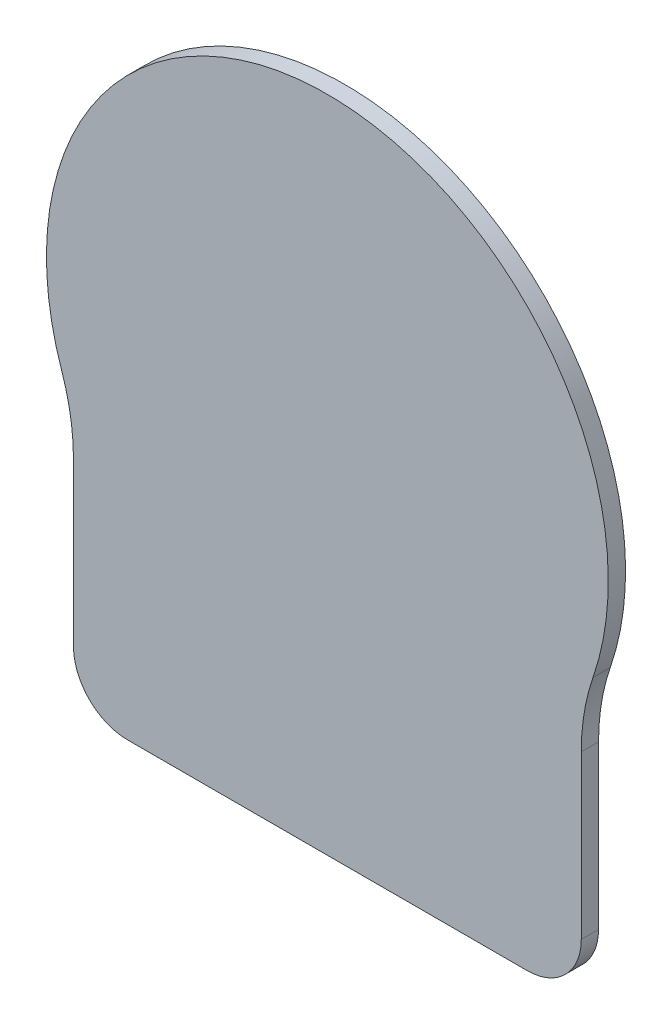
ISO-10303-21;
HEADER;
FILE_DESCRIPTION(('STEP AP214'),'2;1');
FILE_NAME('part.step','',(''),(''),'','','');
FILE_SCHEMA(('AUTOMOTIVE_DESIGN { 1 0 10303 214 1 1 1 1 }'));
ENDSEC;
DATA;
#1=APPLICATION_CONTEXT('core data for automotive mechanical design processes');
#2=APPLICATION_PROTOCOL_DEFINITION('international standard','automotive_design',2000,#1);
#3=PRODUCT_CONTEXT('',#1,'mechanical');
#4=PRODUCT('Part','Part','',(#3));
#5=PRODUCT_RELATED_PRODUCT_CATEGORY('part','',(#4));
#6=PRODUCT_DEFINITION_FORMATION('','',#4);
#7=PRODUCT_DEFINITION_CONTEXT('part definition',#1,'design');
#8=PRODUCT_DEFINITION('design','',#6,#7);
#9=PRODUCT_DEFINITION_SHAPE('','',#8);
#10=(LENGTH_UNIT() NAMED_UNIT(*) SI_UNIT(.MILLI.,.METRE.));
#11=(NAMED_UNIT(*) PLANE_ANGLE_UNIT() SI_UNIT($,.RADIAN.));
#12=(NAMED_UNIT(*) SI_UNIT($,.STERADIAN.) SOLID_ANGLE_UNIT());
#13=UNCERTAINTY_MEASURE_WITH_UNIT(LENGTH_MEASURE(1.E-05),#10,'distance_accuracy_value','');
#14=(GEOMETRIC_REPRESENTATION_CONTEXT(3) GLOBAL_UNCERTAINTY_ASSIGNED_CONTEXT((#13)) GLOBAL_UNIT_ASSIGNED_CONTEXT((#10,
#11,#12)) REPRESENTATION_CONTEXT('',''));
#15=CARTESIAN_POINT('',(0.,0.,0.));
#16=DIRECTION('',(0.,0.,1.));
#17=DIRECTION('',(1.,0.,0.));
#18=AXIS2_PLACEMENT_3D('',#15,#16,#17);
#19=CARTESIAN_POINT('',(-43.5,-14.9582753016516,1.6));
#20=DIRECTION('',(0.,0.,-1.));
#21=DIRECTION('',(-1.,0.,0.));
#22=AXIS2_PLACEMENT_3D('',#19,#20,#21);
#23=CYLINDRICAL_SURFACE('',#22,20.);
#24=CARTESIAN_POINT('',(-43.5,-14.9582753016516,0.));
#25=DIRECTION('',(0.,0.,-1.));
#26=DIRECTION('',(1.,0.,0.));
#27=AXIS2_PLACEMENT_3D('',#24,#25,#26);
#28=CIRCLE('',#27,20.);
#29=CARTESIAN_POINT('',(-24.5869565217391,-8.45467734441177,0.));
#30=VERTEX_POINT('',#29);
#31=CARTESIAN_POINT('',(-23.5,-14.9582753016516,0.));
#32=VERTEX_POINT('',#31);
#33=EDGE_CURVE('E133',#30,#32,#28,.T.);
#34=ORIENTED_EDGE('',*,*,#33,.T.);
#35=DIRECTION('',(0.,0.,-1.));
#36=VECTOR('',#35,1.);
#37=CARTESIAN_POINT('',(-23.5,-14.9582753016516,1.6));
#38=LINE('',#37,#36);
#39=CARTESIAN_POINT('',(-23.5,-14.9582753016516,1.6));
#40=VERTEX_POINT('',#39);
#41=EDGE_CURVE('E11',#40,#32,#38,.T.);
#42=ORIENTED_EDGE('',*,*,#41,.F.);
#43=CARTESIAN_POINT('',(-43.5,-14.9582753016516,1.6));
#44=DIRECTION('',(0.,0.,-1.));
#45=DIRECTION('',(1.,0.,0.));
#46=AXIS2_PLACEMENT_3D('',#43,#44,#45);
#47=CIRCLE('',#46,20.);
#48=CARTESIAN_POINT('',(-24.5869565217391,-8.45467734441177,1.6));
#49=VERTEX_POINT('',#48);
#50=EDGE_CURVE('E147',#49,#40,#47,.T.);
#51=ORIENTED_EDGE('',*,*,#50,.F.);
#52=DIRECTION('',(0.,0.,-1.));
#53=VECTOR('',#52,1.);
#54=CARTESIAN_POINT('',(-24.5869565217391,-8.45467734441177,1.6));
#55=LINE('',#54,#53);
#56=EDGE_CURVE('E129',#49,#30,#55,.T.);
#57=ORIENTED_EDGE('',*,*,#56,.T.);
#58=EDGE_LOOP('',(#34,#42,#51,#57));
#59=FACE_BOUND('',#58,.T.);
#60=ADVANCED_FACE('F37',(#59),#23,.F.);
#61=CARTESIAN_POINT('',(-23.5,-14.9582753016516,1.6));
#62=DIRECTION('',(1.,0.,0.));
#63=DIRECTION('',(0.,0.,-1.));
#64=AXIS2_PLACEMENT_3D('',#61,#62,#63);
#65=PLANE('',#64);
#66=DIRECTION('',(0.,-1.,0.));
#67=VECTOR('',#66,1.);
#68=CARTESIAN_POINT('',(-23.5,-14.9582753016516,0.));
#69=LINE('',#68,#67);
#70=CARTESIAN_POINT('',(-23.5,-30.,0.));
#71=VERTEX_POINT('',#70);
#72=EDGE_CURVE('E136',#32,#71,#69,.T.);
#73=ORIENTED_EDGE('',*,*,#72,.T.);
#74=DIRECTION('',(0.,0.,-1.));
#75=VECTOR('',#74,1.);
#76=CARTESIAN_POINT('',(-23.5,-30.,1.6));
#77=LINE('',#76,#75);
#78=CARTESIAN_POINT('',(-23.5,-30.,1.6));
#79=VERTEX_POINT('',#78);
#80=EDGE_CURVE('E45',#79,#71,#77,.T.);
#81=ORIENTED_EDGE('',*,*,#80,.F.);
#82=DIRECTION('',(0.,-1.,0.));
#83=VECTOR('',#82,1.);
#84=CARTESIAN_POINT('',(-23.5,-14.9582753016516,1.6));
#85=LINE('',#84,#83);
#86=EDGE_CURVE('E96',#40,#79,#85,.T.);
#87=ORIENTED_EDGE('',*,*,#86,.F.);
#88=ORIENTED_EDGE('',*,*,#41,.T.);
#89=EDGE_LOOP('',(#73,#81,#87,#88));
#90=FACE_BOUND('',#89,.T.);
#91=ADVANCED_FACE('F182',(#90),#65,.F.);
#92=CARTESIAN_POINT('',(-18.5,-30.,1.6));
#93=DIRECTION('',(0.,0.,-1.));
#94=DIRECTION('',(-1.,0.,0.));
#95=AXIS2_PLACEMENT_3D('',#92,#93,#94);
#96=CYLINDRICAL_SURFACE('',#95,5.);
#97=CARTESIAN_POINT('',(-18.5,-30.,0.));
#98=DIRECTION('',(0.,0.,1.));
#99=DIRECTION('',(1.,0.,0.));
#100=AXIS2_PLACEMENT_3D('',#97,#98,#99);
#101=CIRCLE('',#100,5.);
#102=CARTESIAN_POINT('',(-18.5,-35.,0.));
#103=VERTEX_POINT('',#102);
#104=EDGE_CURVE('E138',#71,#103,#101,.T.);
#105=ORIENTED_EDGE('',*,*,#104,.T.);
#106=DIRECTION('',(0.,0.,-1.));
#107=VECTOR('',#106,1.);
#108=CARTESIAN_POINT('',(-18.5,-35.,1.6));
#109=LINE('',#108,#107);
#110=CARTESIAN_POINT('',(-18.5,-35.,1.6));
#111=VERTEX_POINT('',#110);
#112=EDGE_CURVE('E154',#111,#103,#109,.T.);
#113=ORIENTED_EDGE('',*,*,#112,.F.);
#114=CARTESIAN_POINT('',(-18.5,-30.,1.6));
#115=DIRECTION('',(0.,0.,1.));
#116=DIRECTION('',(1.,0.,0.));
#117=AXIS2_PLACEMENT_3D('',#114,#115,#116);
#118=CIRCLE('',#117,5.);
#119=EDGE_CURVE('E162',#79,#111,#118,.T.);
#120=ORIENTED_EDGE('',*,*,#119,.F.);
#121=ORIENTED_EDGE('',*,*,#80,.T.);
#122=EDGE_LOOP('',(#105,#113,#120,#121));
#123=FACE_BOUND('',#122,.T.);
#124=ADVANCED_FACE('F160',(#123),#96,.T.);
#125=CARTESIAN_POINT('',(-18.5,-35.,1.6));
#126=DIRECTION('',(0.,1.,0.));
#127=DIRECTION('',(0.,0.,1.));
#128=AXIS2_PLACEMENT_3D('',#125,#126,#127);
#129=PLANE('',#128);
#130=DIRECTION('',(1.,0.,0.));
#131=VECTOR('',#130,1.);
#132=CARTESIAN_POINT('',(-18.5,-35.,0.));
#133=LINE('',#132,#131);
#134=CARTESIAN_POINT('',(18.5,-35.,0.));
#135=VERTEX_POINT('',#134);
#136=EDGE_CURVE('E140',#103,#135,#133,.T.);
#137=ORIENTED_EDGE('',*,*,#136,.T.);
#138=DIRECTION('',(0.,0.,-1.));
#139=VECTOR('',#138,1.);
#140=CARTESIAN_POINT('',(18.5,-35.,1.6));
#141=LINE('',#140,#139);
#142=CARTESIAN_POINT('',(18.5,-35.,1.6));
#143=VERTEX_POINT('',#142);
#144=EDGE_CURVE('E151',#143,#135,#141,.T.);
#145=ORIENTED_EDGE('',*,*,#144,.F.);
#146=DIRECTION('',(1.,0.,0.));
#147=VECTOR('',#146,1.);
#148=CARTESIAN_POINT('',(-18.5,-35.,1.6));
#149=LINE('',#148,#147);
#150=EDGE_CURVE('E174',#111,#143,#149,.T.);
#151=ORIENTED_EDGE('',*,*,#150,.F.);
#152=ORIENTED_EDGE('',*,*,#112,.T.);
#153=EDGE_LOOP('',(#137,#145,#151,#152));
#154=FACE_BOUND('',#153,.T.);
#155=ADVANCED_FACE('F170',(#154),#129,.F.);
#156=CARTESIAN_POINT('',(18.5,-30.,1.6));
#157=DIRECTION('',(0.,0.,-1.));
#158=DIRECTION('',(-1.,0.,0.));
#159=AXIS2_PLACEMENT_3D('',#156,#157,#158);
#160=CYLINDRICAL_SURFACE('',#159,5.);
#161=CARTESIAN_POINT('',(18.5,-30.,0.));
#162=DIRECTION('',(0.,0.,1.));
#163=DIRECTION('',(1.,0.,0.));
#164=AXIS2_PLACEMENT_3D('',#161,#162,#163);
#165=CIRCLE('',#164,5.);
#166=CARTESIAN_POINT('',(23.5,-30.,0.));
#167=VERTEX_POINT('',#166);
#168=EDGE_CURVE('E142',#135,#167,#165,.T.);
#169=ORIENTED_EDGE('',*,*,#168,.T.);
#170=DIRECTION('',(0.,0.,-1.));
#171=VECTOR('',#170,1.);
#172=CARTESIAN_POINT('',(23.5,-30.,1.6));
#173=LINE('',#172,#171);
#174=CARTESIAN_POINT('',(23.5,-30.,1.6));
#175=VERTEX_POINT('',#174);
#176=EDGE_CURVE('E124',#175,#167,#173,.T.);
#177=ORIENTED_EDGE('',*,*,#176,.F.);
#178=CARTESIAN_POINT('',(18.5,-30.,1.6));
#179=DIRECTION('',(0.,0.,1.));
#180=DIRECTION('',(1.,0.,0.));
#181=AXIS2_PLACEMENT_3D('',#178,#179,#180);
#182=CIRCLE('',#181,5.);
#183=EDGE_CURVE('E115',#143,#175,#182,.T.);
#184=ORIENTED_EDGE('',*,*,#183,.F.);
#185=ORIENTED_EDGE('',*,*,#144,.T.);
#186=EDGE_LOOP('',(#169,#177,#184,#185));
#187=FACE_BOUND('',#186,.T.);
#188=ADVANCED_FACE('F173',(#187),#160,.T.);
#189=CARTESIAN_POINT('',(23.5,-14.9582753016516,1.6));
#190=DIRECTION('',(-1.,0.,0.));
#191=DIRECTION('',(0.,-1.,0.));
#192=AXIS2_PLACEMENT_3D('',#189,#190,#191);
#193=PLANE('',#192);
#194=DIRECTION('',(0.,1.,0.));
#195=VECTOR('',#194,1.);
#196=CARTESIAN_POINT('',(23.5,-14.9582753016516,0.));
#197=LINE('',#196,#195);
#198=CARTESIAN_POINT('',(23.5,-14.9582753016516,0.));
#199=VERTEX_POINT('',#198);
#200=EDGE_CURVE('E123',#167,#199,#197,.T.);
#201=ORIENTED_EDGE('',*,*,#200,.T.);
#202=DIRECTION('',(0.,0.,-1.));
#203=VECTOR('',#202,1.);
#204=CARTESIAN_POINT('',(23.5,-14.9582753016516,1.6));
#205=LINE('',#204,#203);
#206=CARTESIAN_POINT('',(23.5,-14.9582753016516,1.6));
#207=VERTEX_POINT('',#206);
#208=EDGE_CURVE('E120',#207,#199,#205,.T.);
#209=ORIENTED_EDGE('',*,*,#208,.F.);
#210=DIRECTION('',(0.,1.,0.));
#211=VECTOR('',#210,1.);
#212=CARTESIAN_POINT('',(23.5,-14.9582753016516,1.6));
#213=LINE('',#212,#211);
#214=EDGE_CURVE('E109',#175,#207,#213,.T.);
#215=ORIENTED_EDGE('',*,*,#214,.F.);
#216=ORIENTED_EDGE('',*,*,#176,.T.);
#217=EDGE_LOOP('',(#201,#209,#215,#216));
#218=FACE_BOUND('',#217,.T.);
#219=ADVANCED_FACE('F121',(#218),#193,.F.);
#220=CARTESIAN_POINT('',(43.5,-14.9582753016516,1.6));
#221=DIRECTION('',(0.,0.,-1.));
#222=DIRECTION('',(-1.,0.,0.));
#223=AXIS2_PLACEMENT_3D('',#220,#221,#222);
#224=CYLINDRICAL_SURFACE('',#223,20.);
#225=CARTESIAN_POINT('',(43.5,-14.9582753016516,0.));
#226=DIRECTION('',(0.,0.,-1.));
#227=DIRECTION('',(1.,0.,0.));
#228=AXIS2_PLACEMENT_3D('',#225,#226,#227);
#229=CIRCLE('',#228,20.);
#230=CARTESIAN_POINT('',(24.5869565217391,-8.45467734441176,0.));
#231=VERTEX_POINT('',#230);
#232=EDGE_CURVE('E82',#199,#231,#229,.T.);
#233=ORIENTED_EDGE('',*,*,#232,.T.);
#234=DIRECTION('',(0.,0.,-1.));
#235=VECTOR('',#234,1.);
#236=CARTESIAN_POINT('',(24.5869565217391,-8.45467734441176,1.6));
#237=LINE('',#236,#235);
#238=CARTESIAN_POINT('',(24.5869565217391,-8.45467734441176,1.6));
#239=VERTEX_POINT('',#238);
#240=EDGE_CURVE('E125',#239,#231,#237,.T.);
#241=ORIENTED_EDGE('',*,*,#240,.F.);
#242=CARTESIAN_POINT('',(43.5,-14.9582753016516,1.6));
#243=DIRECTION('',(0.,0.,-1.));
#244=DIRECTION('',(1.,0.,0.));
#245=AXIS2_PLACEMENT_3D('',#242,#243,#244);
#246=CIRCLE('',#245,20.);
#247=EDGE_CURVE('E113',#207,#239,#246,.T.);
#248=ORIENTED_EDGE('',*,*,#247,.F.);
#249=ORIENTED_EDGE('',*,*,#208,.T.);
#250=EDGE_LOOP('',(#233,#241,#248,#249));
#251=FACE_BOUND('',#250,.T.);
#252=ADVANCED_FACE('F127',(#251),#224,.F.);
#253=CARTESIAN_POINT('',(0.,0.,1.6));
#254=DIRECTION('',(0.,0.,-1.));
#255=DIRECTION('',(-1.,0.,0.));
#256=AXIS2_PLACEMENT_3D('',#253,#254,#255);
#257=CYLINDRICAL_SURFACE('',#256,26.);
#258=CARTESIAN_POINT('',(0.,0.,0.));
#259=DIRECTION('',(0.,0.,1.));
#260=DIRECTION('',(1.,0.,0.));
#261=AXIS2_PLACEMENT_3D('',#258,#259,#260);
#262=CIRCLE('',#261,26.);
#263=EDGE_CURVE('E88',#231,#30,#262,.T.);
#264=ORIENTED_EDGE('',*,*,#263,.T.);
#265=ORIENTED_EDGE('',*,*,#56,.F.);
#266=CARTESIAN_POINT('',(0.,0.,1.6));
#267=DIRECTION('',(0.,0.,1.));
#268=DIRECTION('',(1.,0.,0.));
#269=AXIS2_PLACEMENT_3D('',#266,#267,#268);
#270=CIRCLE('',#269,26.);
#271=EDGE_CURVE('E53',#239,#49,#270,.T.);
#272=ORIENTED_EDGE('',*,*,#271,.F.);
#273=ORIENTED_EDGE('',*,*,#240,.T.);
#274=EDGE_LOOP('',(#264,#265,#272,#273));
#275=FACE_BOUND('',#274,.T.);
#276=ADVANCED_FACE('F198',(#275),#257,.T.);
#277=CARTESIAN_POINT('',(-43.5,-14.9582753016516,1.6));
#278=DIRECTION('',(0.,0.,1.));
#279=DIRECTION('',(1.,0.,0.));
#280=AXIS2_PLACEMENT_3D('',#277,#278,#279);
#281=PLANE('',#280);
#282=ORIENTED_EDGE('',*,*,#50,.T.);
#283=ORIENTED_EDGE('',*,*,#86,.T.);
#284=ORIENTED_EDGE('',*,*,#119,.T.);
#285=ORIENTED_EDGE('',*,*,#150,.T.);
#286=ORIENTED_EDGE('',*,*,#183,.T.);
#287=ORIENTED_EDGE('',*,*,#214,.T.);
#288=ORIENTED_EDGE('',*,*,#247,.T.);
#289=ORIENTED_EDGE('',*,*,#271,.T.);
#290=EDGE_LOOP('',(#282,#283,#284,#285,#286,#287,#288,#289));
#291=FACE_BOUND('',#290,.T.);
#292=ADVANCED_FACE('F111',(#291),#281,.T.);
#293=CARTESIAN_POINT('',(-43.5,-14.9582753016516,0.));
#294=DIRECTION('',(0.,0.,1.));
#295=DIRECTION('',(1.,0.,0.));
#296=AXIS2_PLACEMENT_3D('',#293,#294,#295);
#297=PLANE('',#296);
#298=ORIENTED_EDGE('',*,*,#33,.F.);
#299=ORIENTED_EDGE('',*,*,#263,.F.);
#300=ORIENTED_EDGE('',*,*,#232,.F.);
#301=ORIENTED_EDGE('',*,*,#200,.F.);
#302=ORIENTED_EDGE('',*,*,#168,.F.);
#303=ORIENTED_EDGE('',*,*,#136,.F.);
#304=ORIENTED_EDGE('',*,*,#104,.F.);
#305=ORIENTED_EDGE('',*,*,#72,.F.);
#306=EDGE_LOOP('',(#298,#299,#300,#301,#302,#303,#304,#305));
#307=FACE_BOUND('',#306,.T.);
#308=ADVANCED_FACE('F166',(#307),#297,.F.);
#309=CLOSED_SHELL('',(#60,#91,#124,#155,#188,#219,#252,#276,#292,#308));
#310=MANIFOLD_SOLID_BREP('B2',#309);
#311=ADVANCED_BREP_SHAPE_REPRESENTATION('',(#18,#310),#14);
#312=SHAPE_DEFINITION_REPRESENTATION(#9,#311);
ENDSEC;
END-ISO-10303-21;
